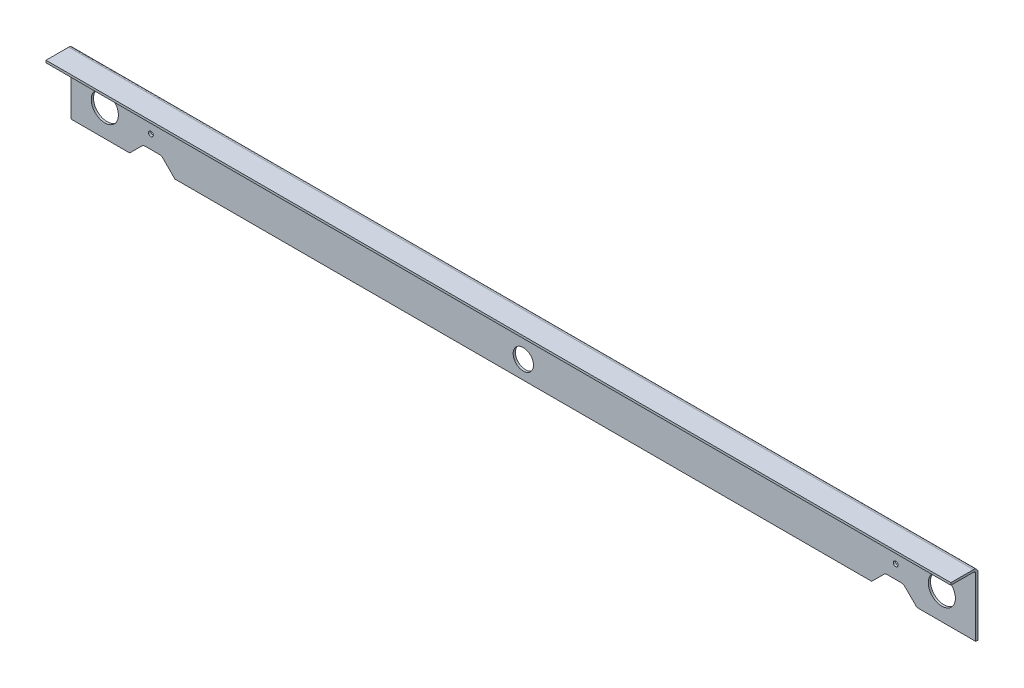
ISO-10303-21;
HEADER;
FILE_DESCRIPTION(('STEP AP214'),'2;1');
FILE_NAME('part.step','',(''),(''),'','','');
FILE_SCHEMA(('AUTOMOTIVE_DESIGN { 1 0 10303 214 1 1 1 1 }'));
ENDSEC;
DATA;
#1=APPLICATION_CONTEXT('core data for automotive mechanical design processes');
#2=APPLICATION_PROTOCOL_DEFINITION('international standard','automotive_design',2000,#1);
#3=PRODUCT_CONTEXT('',#1,'mechanical');
#4=PRODUCT('Part','Part','',(#3));
#5=PRODUCT_RELATED_PRODUCT_CATEGORY('part','',(#4));
#6=PRODUCT_DEFINITION_FORMATION('','',#4);
#7=PRODUCT_DEFINITION_CONTEXT('part definition',#1,'design');
#8=PRODUCT_DEFINITION('design','',#6,#7);
#9=PRODUCT_DEFINITION_SHAPE('','',#8);
#10=(LENGTH_UNIT() NAMED_UNIT(*) SI_UNIT(.MILLI.,.METRE.));
#11=(NAMED_UNIT(*) PLANE_ANGLE_UNIT() SI_UNIT($,.RADIAN.));
#12=(NAMED_UNIT(*) SI_UNIT($,.STERADIAN.) SOLID_ANGLE_UNIT());
#13=UNCERTAINTY_MEASURE_WITH_UNIT(LENGTH_MEASURE(1.E-05),#10,'distance_accuracy_value','');
#14=(GEOMETRIC_REPRESENTATION_CONTEXT(3) GLOBAL_UNCERTAINTY_ASSIGNED_CONTEXT((#13)) GLOBAL_UNIT_ASSIGNED_CONTEXT((#10,
#11,#12)) REPRESENTATION_CONTEXT('',''));
#15=CARTESIAN_POINT('',(0.,0.,0.));
#16=DIRECTION('',(0.,0.,1.));
#17=DIRECTION('',(1.,0.,0.));
#18=AXIS2_PLACEMENT_3D('',#15,#16,#17);
#19=CARTESIAN_POINT('',(635.,0.,34.925));
#20=DIRECTION('',(0.,0.,1.));
#21=DIRECTION('',(1.,0.,0.));
#22=AXIS2_PLACEMENT_3D('',#19,#20,#21);
#23=PLANE('',#22);
#24=DIRECTION('',(1.,0.,0.));
#25=VECTOR('',#24,1.);
#26=CARTESIAN_POINT('',(635.,-3.175,34.925));
#27=LINE('',#26,#25);
#28=CARTESIAN_POINT('',(635.,-3.175,34.925));
#29=VERTEX_POINT('',#28);
#30=CARTESIAN_POINT('',(-635.,-3.175,34.925));
#31=VERTEX_POINT('',#30);
#32=EDGE_CURVE('E106',#29,#31,#27,.F.);
#33=ORIENTED_EDGE('',*,*,#32,.F.);
#34=DIRECTION('',(0.,1.,0.));
#35=VECTOR('',#34,1.);
#36=CARTESIAN_POINT('',(635.,0.,34.925));
#37=LINE('',#36,#35);
#38=CARTESIAN_POINT('',(635.,0.,34.925));
#39=VERTEX_POINT('',#38);
#40=EDGE_CURVE('E247',#39,#29,#37,.F.);
#41=ORIENTED_EDGE('',*,*,#40,.F.);
#42=DIRECTION('',(1.,0.,0.));
#43=VECTOR('',#42,1.);
#44=CARTESIAN_POINT('',(-635.,0.,34.925));
#45=LINE('',#44,#43);
#46=CARTESIAN_POINT('',(-635.,0.,34.925));
#47=VERTEX_POINT('',#46);
#48=EDGE_CURVE('E157',#47,#39,#45,.T.);
#49=ORIENTED_EDGE('',*,*,#48,.F.);
#50=DIRECTION('',(0.,1.,0.));
#51=VECTOR('',#50,1.);
#52=CARTESIAN_POINT('',(-635.,0.,34.925));
#53=LINE('',#52,#51);
#54=EDGE_CURVE('E272',#47,#31,#53,.F.);
#55=ORIENTED_EDGE('',*,*,#54,.T.);
#56=EDGE_LOOP('',(#33,#41,#49,#55));
#57=FACE_BOUND('',#56,.T.);
#58=ADVANCED_FACE('F17',(#57),#23,.T.);
#59=CARTESIAN_POINT('',(635.,-3.175,34.925));
#60=DIRECTION('',(0.,-1.,0.));
#61=DIRECTION('',(0.,0.,-1.));
#62=AXIS2_PLACEMENT_3D('',#59,#60,#61);
#63=PLANE('',#62);
#64=DIRECTION('',(0.,0.,-1.));
#65=VECTOR('',#64,1.);
#66=CARTESIAN_POINT('',(-635.,-3.175,0.));
#67=LINE('',#66,#65);
#68=CARTESIAN_POINT('',(-635.,-3.175,3.175));
#69=VERTEX_POINT('',#68);
#70=EDGE_CURVE('E274',#31,#69,#67,.T.);
#71=ORIENTED_EDGE('',*,*,#70,.T.);
#72=DIRECTION('',(1.,0.,0.));
#73=VECTOR('',#72,1.);
#74=CARTESIAN_POINT('',(-2290.572,-3.175,3.175));
#75=LINE('',#74,#73);
#76=CARTESIAN_POINT('',(635.,-3.175,3.175));
#77=VERTEX_POINT('',#76);
#78=EDGE_CURVE('E95',#69,#77,#75,.T.);
#79=ORIENTED_EDGE('',*,*,#78,.T.);
#80=DIRECTION('',(0.,0.,-1.));
#81=VECTOR('',#80,1.);
#82=CARTESIAN_POINT('',(635.,-3.175,0.));
#83=LINE('',#82,#81);
#84=EDGE_CURVE('E244',#29,#77,#83,.T.);
#85=ORIENTED_EDGE('',*,*,#84,.F.);
#86=ORIENTED_EDGE('',*,*,#32,.T.);
#87=EDGE_LOOP('',(#71,#79,#85,#86));
#88=FACE_BOUND('',#87,.T.);
#89=ADVANCED_FACE('F706',(#88),#63,.T.);
#90=CARTESIAN_POINT('',(-2290.572,-6.35,3.175));
#91=DIRECTION('',(1.,0.,0.));
#92=DIRECTION('',(0.,0.,-1.));
#93=AXIS2_PLACEMENT_3D('',#90,#91,#92);
#94=CYLINDRICAL_SURFACE('',#93,3.175);
#95=ORIENTED_EDGE('',*,*,#78,.F.);
#96=CARTESIAN_POINT('',(-635.,-6.35,3.175));
#97=DIRECTION('',(1.,0.,0.));
#98=DIRECTION('',(0.,0.,-1.));
#99=AXIS2_PLACEMENT_3D('',#96,#97,#98);
#100=CIRCLE('',#99,3.175);
#101=CARTESIAN_POINT('',(-635.,-6.35,0.));
#102=VERTEX_POINT('',#101);
#103=EDGE_CURVE('E366',#69,#102,#100,.F.);
#104=ORIENTED_EDGE('',*,*,#103,.T.);
#105=DIRECTION('',(1.,0.,0.));
#106=VECTOR('',#105,1.);
#107=CARTESIAN_POINT('',(-635.,-6.35,0.));
#108=LINE('',#107,#106);
#109=CARTESIAN_POINT('',(635.,-6.35,0.));
#110=VERTEX_POINT('',#109);
#111=EDGE_CURVE('E253',#110,#102,#108,.F.);
#112=ORIENTED_EDGE('',*,*,#111,.F.);
#113=CARTESIAN_POINT('',(635.,-6.35,3.175));
#114=DIRECTION('',(1.,0.,0.));
#115=DIRECTION('',(0.,0.,-1.));
#116=AXIS2_PLACEMENT_3D('',#113,#114,#115);
#117=CIRCLE('',#116,3.175);
#118=EDGE_CURVE('E20',#77,#110,#117,.F.);
#119=ORIENTED_EDGE('',*,*,#118,.F.);
#120=EDGE_LOOP('',(#95,#104,#112,#119));
#121=FACE_BOUND('',#120,.T.);
#122=ADVANCED_FACE('F697',(#121),#94,.F.);
#123=CARTESIAN_POINT('',(-635.,0.,-3.175));
#124=DIRECTION('',(0.,1.,0.));
#125=DIRECTION('',(0.,0.,1.));
#126=AXIS2_PLACEMENT_3D('',#123,#124,#125);
#127=PLANE('',#126);
#128=DIRECTION('',(0.,0.,-1.));
#129=VECTOR('',#128,1.);
#130=CARTESIAN_POINT('',(635.,0.,0.));
#131=LINE('',#130,#129);
#132=CARTESIAN_POINT('',(635.,0.,3.175));
#133=VERTEX_POINT('',#132);
#134=EDGE_CURVE('E250',#133,#39,#131,.F.);
#135=ORIENTED_EDGE('',*,*,#134,.F.);
#136=DIRECTION('',(-1.,0.,0.));
#137=VECTOR('',#136,1.);
#138=CARTESIAN_POINT('',(2290.572,0.,3.175));
#139=LINE('',#138,#137);
#140=CARTESIAN_POINT('',(-635.,0.,3.175));
#141=VERTEX_POINT('',#140);
#142=EDGE_CURVE('E256',#141,#133,#139,.F.);
#143=ORIENTED_EDGE('',*,*,#142,.F.);
#144=DIRECTION('',(0.,0.,-1.));
#145=VECTOR('',#144,1.);
#146=CARTESIAN_POINT('',(-635.,0.,0.));
#147=LINE('',#146,#145);
#148=EDGE_CURVE('E275',#141,#47,#147,.F.);
#149=ORIENTED_EDGE('',*,*,#148,.T.);
#150=ORIENTED_EDGE('',*,*,#48,.T.);
#151=EDGE_LOOP('',(#135,#143,#149,#150));
#152=FACE_BOUND('',#151,.T.);
#153=ADVANCED_FACE('F688',(#152),#127,.T.);
#154=CARTESIAN_POINT('',(-635.,0.,0.));
#155=DIRECTION('',(0.,0.,1.));
#156=DIRECTION('',(1.,0.,0.));
#157=AXIS2_PLACEMENT_3D('',#154,#155,#156);
#158=PLANE('',#157);
#159=CARTESIAN_POINT('',(522.6558,-50.8,0.));
#160=DIRECTION('',(0.,0.,1.));
#161=DIRECTION('',(1.,0.,0.));
#162=AXIS2_PLACEMENT_3D('',#159,#160,#161);
#163=CIRCLE('',#162,3.3655);
#164=CARTESIAN_POINT('',(526.0213,-50.8,0.));
#165=VERTEX_POINT('',#164);
#166=EDGE_CURVE('E238',#165,#165,#163,.F.);
#167=ORIENTED_EDGE('',*,*,#166,.T.);
#168=EDGE_LOOP('',(#167));
#169=FACE_BOUND('',#168,.T.);
#170=CARTESIAN_POINT('',(522.6558,-22.225,0.));
#171=DIRECTION('',(0.,0.,1.));
#172=DIRECTION('',(1.,0.,0.));
#173=AXIS2_PLACEMENT_3D('',#170,#171,#172);
#174=CIRCLE('',#173,3.3655);
#175=CARTESIAN_POINT('',(526.0213,-22.225,0.));
#176=VERTEX_POINT('',#175);
#177=EDGE_CURVE('E345',#176,#176,#174,.F.);
#178=ORIENTED_EDGE('',*,*,#177,.T.);
#179=EDGE_LOOP('',(#178));
#180=FACE_BOUND('',#179,.T.);
#181=CARTESIAN_POINT('',(-522.6558,-22.225,0.));
#182=DIRECTION('',(0.,0.,1.));
#183=DIRECTION('',(1.,0.,0.));
#184=AXIS2_PLACEMENT_3D('',#181,#182,#183);
#185=CIRCLE('',#184,3.3655);
#186=CARTESIAN_POINT('',(-519.2903,-22.225,0.));
#187=VERTEX_POINT('',#186);
#188=EDGE_CURVE('E348',#187,#187,#185,.F.);
#189=ORIENTED_EDGE('',*,*,#188,.T.);
#190=EDGE_LOOP('',(#189));
#191=FACE_BOUND('',#190,.T.);
#192=CARTESIAN_POINT('',(-522.6558,-50.8,0.));
#193=DIRECTION('',(0.,0.,1.));
#194=DIRECTION('',(1.,0.,0.));
#195=AXIS2_PLACEMENT_3D('',#192,#193,#194);
#196=CIRCLE('',#195,3.3655);
#197=CARTESIAN_POINT('',(-519.2903,-50.8,0.));
#198=VERTEX_POINT('',#197);
#199=EDGE_CURVE('E351',#198,#198,#196,.F.);
#200=ORIENTED_EDGE('',*,*,#199,.T.);
#201=EDGE_LOOP('',(#200));
#202=FACE_BOUND('',#201,.T.);
#203=CARTESIAN_POINT('',(-587.375,-50.8,0.));
#204=DIRECTION('',(0.,0.,1.));
#205=DIRECTION('',(1.,0.,0.));
#206=AXIS2_PLACEMENT_3D('',#203,#204,#205);
#207=CIRCLE('',#206,19.05);
#208=CARTESIAN_POINT('',(-568.325,-50.8,0.));
#209=VERTEX_POINT('',#208);
#210=EDGE_CURVE('E354',#209,#209,#207,.F.);
#211=ORIENTED_EDGE('',*,*,#210,.T.);
#212=EDGE_LOOP('',(#211));
#213=FACE_BOUND('',#212,.T.);
#214=CARTESIAN_POINT('',(0.,-63.5,0.));
#215=DIRECTION('',(0.,0.,1.));
#216=DIRECTION('',(1.,0.,0.));
#217=AXIS2_PLACEMENT_3D('',#214,#215,#216);
#218=CIRCLE('',#217,14.2875);
#219=CARTESIAN_POINT('',(14.2875,-63.5,0.));
#220=VERTEX_POINT('',#219);
#221=EDGE_CURVE('E357',#220,#220,#218,.F.);
#222=ORIENTED_EDGE('',*,*,#221,.T.);
#223=EDGE_LOOP('',(#222));
#224=FACE_BOUND('',#223,.T.);
#225=CARTESIAN_POINT('',(587.375,-50.8,0.));
#226=DIRECTION('',(0.,0.,1.));
#227=DIRECTION('',(1.,0.,0.));
#228=AXIS2_PLACEMENT_3D('',#225,#226,#227);
#229=CIRCLE('',#228,19.05);
#230=CARTESIAN_POINT('',(606.425,-50.8,0.));
#231=VERTEX_POINT('',#230);
#232=EDGE_CURVE('E360',#231,#231,#229,.F.);
#233=ORIENTED_EDGE('',*,*,#232,.T.);
#234=EDGE_LOOP('',(#233));
#235=FACE_BOUND('',#234,.T.);
#236=DIRECTION('',(0.,1.,0.));
#237=VECTOR('',#236,1.);
#238=CARTESIAN_POINT('',(635.,0.,0.));
#239=LINE('',#238,#237);
#240=CARTESIAN_POINT('',(635.,-88.9,0.));
#241=VERTEX_POINT('',#240);
#242=EDGE_CURVE('E233',#110,#241,#239,.F.);
#243=ORIENTED_EDGE('',*,*,#242,.F.);
#244=ORIENTED_EDGE('',*,*,#111,.T.);
#245=DIRECTION('',(0.,1.,0.));
#246=VECTOR('',#245,1.);
#247=CARTESIAN_POINT('',(-635.,0.,0.));
#248=LINE('',#247,#246);
#249=CARTESIAN_POINT('',(-635.,-88.9,0.));
#250=VERTEX_POINT('',#249);
#251=EDGE_CURVE('E368',#102,#250,#248,.F.);
#252=ORIENTED_EDGE('',*,*,#251,.T.);
#253=DIRECTION('',(1.,0.,0.));
#254=VECTOR('',#253,1.);
#255=CARTESIAN_POINT('',(-635.,-88.9,0.));
#256=LINE('',#255,#254);
#257=CARTESIAN_POINT('',(-552.449999999987,-88.9000000000127,0.));
#258=VERTEX_POINT('',#257);
#259=EDGE_CURVE('E164',#258,#250,#256,.F.);
#260=ORIENTED_EDGE('',*,*,#259,.F.);
#261=DIRECTION('',(-0.707106781186548,-0.707106781186548,0.));
#262=VECTOR('',#261,1.);
#263=CARTESIAN_POINT('',(-535.25987193938,-71.7098719394562,0.));
#264=LINE('',#263,#262);
#265=CARTESIAN_POINT('',(-535.259871939424,-71.7098719395007,0.));
#266=VERTEX_POINT('',#265);
#267=EDGE_CURVE('E281',#258,#266,#264,.F.);
#268=ORIENTED_EDGE('',*,*,#267,.T.);
#269=CARTESIAN_POINT('',(-530.769743879014,-76.2,0.));
#270=DIRECTION('',(0.,0.,1.));
#271=DIRECTION('',(1.,0.,0.));
#272=AXIS2_PLACEMENT_3D('',#269,#270,#271);
#273=CIRCLE('',#272,6.35);
#274=CARTESIAN_POINT('',(-530.769743879014,-69.85,0.));
#275=VERTEX_POINT('',#274);
#276=EDGE_CURVE('E369',#266,#275,#273,.F.);
#277=ORIENTED_EDGE('',*,*,#276,.T.);
#278=DIRECTION('',(1.,0.,0.));
#279=VECTOR('',#278,1.);
#280=CARTESIAN_POINT('',(-510.630256120986,-69.85,0.));
#281=LINE('',#280,#279);
#282=CARTESIAN_POINT('',(-510.630256120986,-69.85,0.));
#283=VERTEX_POINT('',#282);
#284=EDGE_CURVE('E286',#275,#283,#281,.T.);
#285=ORIENTED_EDGE('',*,*,#284,.T.);
#286=CARTESIAN_POINT('',(-510.630256120986,-76.2,0.));
#287=DIRECTION('',(0.,0.,1.));
#288=DIRECTION('',(1.,0.,0.));
#289=AXIS2_PLACEMENT_3D('',#286,#287,#288);
#290=CIRCLE('',#289,6.35);
#291=CARTESIAN_POINT('',(-506.140128060517,-71.7098719394418,0.));
#292=VERTEX_POINT('',#291);
#293=EDGE_CURVE('E371',#283,#292,#290,.F.);
#294=ORIENTED_EDGE('',*,*,#293,.T.);
#295=DIRECTION('',(-0.707106781186548,0.707106781186548,0.));
#296=VECTOR('',#295,1.);
#297=CARTESIAN_POINT('',(-488.95,-88.9,0.));
#298=LINE('',#297,#296);
#299=CARTESIAN_POINT('',(-488.95,-88.9,0.));
#300=VERTEX_POINT('',#299);
#301=EDGE_CURVE('E175',#292,#300,#298,.F.);
#302=ORIENTED_EDGE('',*,*,#301,.T.);
#303=DIRECTION('',(1.,0.,0.));
#304=VECTOR('',#303,1.);
#305=CARTESIAN_POINT('',(-635.,-88.9,0.));
#306=LINE('',#305,#304);
#307=CARTESIAN_POINT('',(488.95,-88.9,0.));
#308=VERTEX_POINT('',#307);
#309=EDGE_CURVE('E177',#308,#300,#306,.F.);
#310=ORIENTED_EDGE('',*,*,#309,.F.);
#311=DIRECTION('',(0.707106781186548,0.707106781186548,0.));
#312=VECTOR('',#311,1.);
#313=CARTESIAN_POINT('',(488.95,-88.9,0.));
#314=LINE('',#313,#312);
#315=CARTESIAN_POINT('',(506.140128060537,-71.7098719394626,0.));
#316=VERTEX_POINT('',#315);
#317=EDGE_CURVE('E181',#316,#308,#314,.F.);
#318=ORIENTED_EDGE('',*,*,#317,.F.);
#319=CARTESIAN_POINT('',(510.630256120986,-76.2,0.));
#320=DIRECTION('',(0.,0.,-1.));
#321=DIRECTION('',(-1.,0.,0.));
#322=AXIS2_PLACEMENT_3D('',#319,#320,#321);
#323=CIRCLE('',#322,6.35);
#324=CARTESIAN_POINT('',(510.630256120986,-69.85,0.));
#325=VERTEX_POINT('',#324);
#326=EDGE_CURVE('E211',#316,#325,#323,.T.);
#327=ORIENTED_EDGE('',*,*,#326,.T.);
#328=DIRECTION('',(1.,0.,0.));
#329=VECTOR('',#328,1.);
#330=CARTESIAN_POINT('',(510.630256120986,-69.85,0.));
#331=LINE('',#330,#329);
#332=CARTESIAN_POINT('',(530.769743879014,-69.85,0.));
#333=VERTEX_POINT('',#332);
#334=EDGE_CURVE('E215',#333,#325,#331,.F.);
#335=ORIENTED_EDGE('',*,*,#334,.F.);
#336=CARTESIAN_POINT('',(530.769743879014,-76.2,0.));
#337=DIRECTION('',(0.,0.,-1.));
#338=DIRECTION('',(-1.,0.,0.));
#339=AXIS2_PLACEMENT_3D('',#336,#337,#338);
#340=CIRCLE('',#339,6.35);
#341=CARTESIAN_POINT('',(535.259871939464,-71.7098719394608,0.));
#342=VERTEX_POINT('',#341);
#343=EDGE_CURVE('E217',#333,#342,#340,.T.);
#344=ORIENTED_EDGE('',*,*,#343,.T.);
#345=DIRECTION('',(0.707106781186548,-0.707106781186548,0.));
#346=VECTOR('',#345,1.);
#347=CARTESIAN_POINT('',(535.25987193938,-71.7098719394562,0.));
#348=LINE('',#347,#346);
#349=CARTESIAN_POINT('',(552.449999999975,-88.9000000000254,0.));
#350=VERTEX_POINT('',#349);
#351=EDGE_CURVE('E219',#350,#342,#348,.F.);
#352=ORIENTED_EDGE('',*,*,#351,.F.);
#353=DIRECTION('',(1.,0.,0.));
#354=VECTOR('',#353,1.);
#355=CARTESIAN_POINT('',(-635.,-88.9,0.));
#356=LINE('',#355,#354);
#357=EDGE_CURVE('E220',#241,#350,#356,.F.);
#358=ORIENTED_EDGE('',*,*,#357,.F.);
#359=EDGE_LOOP('',(#243,#244,#252,#260,#268,#277,#285,#294,#302,#310,#318,#327,#335,#344,#352,#358));
#360=FACE_BOUND('',#359,.T.);
#361=ADVANCED_FACE('F180',(#169,#180,#191,#202,#213,#224,#235,#360),#158,.T.);
#362=CARTESIAN_POINT('',(635.,0.,0.));
#363=DIRECTION('',(1.,0.,0.));
#364=DIRECTION('',(0.,0.,-1.));
#365=AXIS2_PLACEMENT_3D('',#362,#363,#364);
#366=PLANE('',#365);
#367=DIRECTION('',(0.,1.,0.));
#368=VECTOR('',#367,1.);
#369=CARTESIAN_POINT('',(635.,-88.9,-3.175));
#370=LINE('',#369,#368);
#371=CARTESIAN_POINT('',(635.,-6.35,-3.175));
#372=VERTEX_POINT('',#371);
#373=CARTESIAN_POINT('',(635.,-88.9,-3.175));
#374=VERTEX_POINT('',#373);
#375=EDGE_CURVE('E227',#372,#374,#370,.F.);
#376=ORIENTED_EDGE('',*,*,#375,.F.);
#377=CARTESIAN_POINT('',(635.,-6.35,3.175));
#378=DIRECTION('',(-1.,0.,0.));
#379=DIRECTION('',(0.,0.,1.));
#380=AXIS2_PLACEMENT_3D('',#377,#378,#379);
#381=CIRCLE('',#380,6.35);
#382=EDGE_CURVE('E259',#133,#372,#381,.T.);
#383=ORIENTED_EDGE('',*,*,#382,.F.);
#384=ORIENTED_EDGE('',*,*,#134,.T.);
#385=ORIENTED_EDGE('',*,*,#40,.T.);
#386=ORIENTED_EDGE('',*,*,#84,.T.);
#387=ORIENTED_EDGE('',*,*,#118,.T.);
#388=ORIENTED_EDGE('',*,*,#242,.T.);
#389=DIRECTION('',(0.,0.,-1.));
#390=VECTOR('',#389,1.);
#391=CARTESIAN_POINT('',(635.,-88.9,0.));
#392=LINE('',#391,#390);
#393=EDGE_CURVE('E230',#374,#241,#392,.F.);
#394=ORIENTED_EDGE('',*,*,#393,.F.);
#395=EDGE_LOOP('',(#376,#383,#384,#385,#386,#387,#388,#394));
#396=FACE_BOUND('',#395,.T.);
#397=ADVANCED_FACE('F452',(#396),#366,.T.);
#398=CARTESIAN_POINT('',(-635.,-88.9,0.));
#399=DIRECTION('',(0.,-1.,0.));
#400=DIRECTION('',(0.,0.,-1.));
#401=AXIS2_PLACEMENT_3D('',#398,#399,#400);
#402=PLANE('',#401);
#403=ORIENTED_EDGE('',*,*,#357,.T.);
#404=DIRECTION('',(0.,0.,1.));
#405=VECTOR('',#404,1.);
#406=CARTESIAN_POINT('',(552.449999999962,-88.9000000000381,0.));
#407=LINE('',#406,#405);
#408=CARTESIAN_POINT('',(552.449999999988,-88.9000000000128,-3.175));
#409=VERTEX_POINT('',#408);
#410=EDGE_CURVE('E147',#409,#350,#407,.T.);
#411=ORIENTED_EDGE('',*,*,#410,.F.);
#412=DIRECTION('',(-1.,0.,0.));
#413=VECTOR('',#412,1.);
#414=CARTESIAN_POINT('',(-635.,-88.9,-3.175));
#415=LINE('',#414,#413);
#416=EDGE_CURVE('E223',#374,#409,#415,.T.);
#417=ORIENTED_EDGE('',*,*,#416,.F.);
#418=ORIENTED_EDGE('',*,*,#393,.T.);
#419=EDGE_LOOP('',(#403,#411,#417,#418));
#420=FACE_BOUND('',#419,.T.);
#421=ADVANCED_FACE('F454',(#420),#402,.T.);
#422=CARTESIAN_POINT('',(535.25987193938,-71.7098719394562,0.));
#423=DIRECTION('',(-0.707106781186548,-0.707106781186548,0.));
#424=DIRECTION('',(0.707106781186548,-0.707106781186548,0.));
#425=AXIS2_PLACEMENT_3D('',#422,#423,#424);
#426=PLANE('',#425);
#427=ORIENTED_EDGE('',*,*,#351,.T.);
#428=DIRECTION('',(0.,0.,-1.));
#429=VECTOR('',#428,1.);
#430=CARTESIAN_POINT('',(535.25987193946,-71.7098719393765,0.));
#431=LINE('',#430,#429);
#432=CARTESIAN_POINT('',(535.259871939459,-71.7098719394558,-3.175));
#433=VERTEX_POINT('',#432);
#434=EDGE_CURVE('E138',#342,#433,#431,.T.);
#435=ORIENTED_EDGE('',*,*,#434,.T.);
#436=DIRECTION('',(-0.707106781188118,0.707106781184977,0.));
#437=VECTOR('',#436,1.);
#438=CARTESIAN_POINT('',(552.45,-88.9,-3.175));
#439=LINE('',#438,#437);
#440=EDGE_CURVE('E226',#409,#433,#439,.T.);
#441=ORIENTED_EDGE('',*,*,#440,.F.);
#442=ORIENTED_EDGE('',*,*,#410,.T.);
#443=EDGE_LOOP('',(#427,#435,#441,#442));
#444=FACE_BOUND('',#443,.T.);
#445=ADVANCED_FACE('F377',(#444),#426,.T.);
#446=CARTESIAN_POINT('',(530.769743879014,-76.2,0.));
#447=DIRECTION('',(0.,0.,-1.));
#448=DIRECTION('',(-1.,0.,0.));
#449=AXIS2_PLACEMENT_3D('',#446,#447,#448);
#450=CYLINDRICAL_SURFACE('',#449,6.35);
#451=ORIENTED_EDGE('',*,*,#434,.F.);
#452=ORIENTED_EDGE('',*,*,#343,.F.);
#453=DIRECTION('',(0.,0.,-1.));
#454=VECTOR('',#453,1.);
#455=CARTESIAN_POINT('',(530.769743879014,-69.85,0.));
#456=LINE('',#455,#454);
#457=CARTESIAN_POINT('',(530.769743879014,-69.85,-3.175));
#458=VERTEX_POINT('',#457);
#459=EDGE_CURVE('E212',#458,#333,#456,.F.);
#460=ORIENTED_EDGE('',*,*,#459,.F.);
#461=CARTESIAN_POINT('',(530.769743879014,-76.2,-3.175));
#462=DIRECTION('',(0.,0.,-1.));
#463=DIRECTION('',(-1.,0.,0.));
#464=AXIS2_PLACEMENT_3D('',#461,#462,#463);
#465=CIRCLE('',#464,6.35);
#466=EDGE_CURVE('E340',#433,#458,#465,.F.);
#467=ORIENTED_EDGE('',*,*,#466,.F.);
#468=EDGE_LOOP('',(#451,#452,#460,#467));
#469=FACE_BOUND('',#468,.T.);
#470=ADVANCED_FACE('F378',(#469),#450,.F.);
#471=CARTESIAN_POINT('',(510.630256120986,-69.85,0.));
#472=DIRECTION('',(0.,-1.,0.));
#473=DIRECTION('',(0.,0.,-1.));
#474=AXIS2_PLACEMENT_3D('',#471,#472,#473);
#475=PLANE('',#474);
#476=ORIENTED_EDGE('',*,*,#334,.T.);
#477=DIRECTION('',(0.,0.,-1.));
#478=VECTOR('',#477,1.);
#479=CARTESIAN_POINT('',(510.630256120986,-69.85,0.));
#480=LINE('',#479,#478);
#481=CARTESIAN_POINT('',(510.630256120986,-69.85,-3.175));
#482=VERTEX_POINT('',#481);
#483=EDGE_CURVE('E194',#325,#482,#480,.T.);
#484=ORIENTED_EDGE('',*,*,#483,.T.);
#485=DIRECTION('',(-1.,0.,0.));
#486=VECTOR('',#485,1.);
#487=CARTESIAN_POINT('',(-635.,-69.85,-3.175));
#488=LINE('',#487,#486);
#489=EDGE_CURVE('E339',#458,#482,#488,.T.);
#490=ORIENTED_EDGE('',*,*,#489,.F.);
#491=ORIENTED_EDGE('',*,*,#459,.T.);
#492=EDGE_LOOP('',(#476,#484,#490,#491));
#493=FACE_BOUND('',#492,.T.);
#494=ADVANCED_FACE('F530',(#493),#475,.T.);
#495=CARTESIAN_POINT('',(510.630256120986,-76.2,0.));
#496=DIRECTION('',(0.,0.,-1.));
#497=DIRECTION('',(-1.,0.,0.));
#498=AXIS2_PLACEMENT_3D('',#495,#496,#497);
#499=CYLINDRICAL_SURFACE('',#498,6.35);
#500=ORIENTED_EDGE('',*,*,#483,.F.);
#501=ORIENTED_EDGE('',*,*,#326,.F.);
#502=DIRECTION('',(0.,0.,1.));
#503=VECTOR('',#502,1.);
#504=CARTESIAN_POINT('',(506.140128060582,-71.7098719394181,0.));
#505=LINE('',#504,#503);
#506=CARTESIAN_POINT('',(506.140128060561,-71.7098719394766,-3.175));
#507=VERTEX_POINT('',#506);
#508=EDGE_CURVE('E187',#507,#316,#505,.T.);
#509=ORIENTED_EDGE('',*,*,#508,.F.);
#510=CARTESIAN_POINT('',(510.630256120986,-76.2,-3.175));
#511=DIRECTION('',(0.,0.,-1.));
#512=DIRECTION('',(-1.,0.,0.));
#513=AXIS2_PLACEMENT_3D('',#510,#511,#512);
#514=CIRCLE('',#513,6.35);
#515=EDGE_CURVE('E335',#482,#507,#514,.F.);
#516=ORIENTED_EDGE('',*,*,#515,.F.);
#517=EDGE_LOOP('',(#500,#501,#509,#516));
#518=FACE_BOUND('',#517,.T.);
#519=ADVANCED_FACE('F527',(#518),#499,.F.);
#520=CARTESIAN_POINT('',(488.95,-88.9,0.));
#521=DIRECTION('',(0.707106781186548,-0.707106781186548,0.));
#522=DIRECTION('',(0.707106781186548,0.707106781186548,0.));
#523=AXIS2_PLACEMENT_3D('',#520,#521,#522);
#524=PLANE('',#523);
#525=DIRECTION('',(-0.707106781188113,-0.707106781184982,0.));
#526=VECTOR('',#525,1.);
#527=CARTESIAN_POINT('',(506.14012806062,-71.7098719394562,-3.175));
#528=LINE('',#527,#526);
#529=CARTESIAN_POINT('',(488.95,-88.9,-3.175));
#530=VERTEX_POINT('',#529);
#531=EDGE_CURVE('E338',#507,#530,#528,.T.);
#532=ORIENTED_EDGE('',*,*,#531,.F.);
#533=ORIENTED_EDGE('',*,*,#508,.T.);
#534=ORIENTED_EDGE('',*,*,#317,.T.);
#535=DIRECTION('',(0.,0.,-1.));
#536=VECTOR('',#535,1.);
#537=CARTESIAN_POINT('',(488.95,-88.9,0.));
#538=LINE('',#537,#536);
#539=EDGE_CURVE('E186',#530,#308,#538,.F.);
#540=ORIENTED_EDGE('',*,*,#539,.F.);
#541=EDGE_LOOP('',(#532,#533,#534,#540));
#542=FACE_BOUND('',#541,.T.);
#543=ADVANCED_FACE('F192',(#542),#524,.T.);
#544=CARTESIAN_POINT('',(-635.,-88.9,0.));
#545=DIRECTION('',(0.,-1.,0.));
#546=DIRECTION('',(0.,0.,-1.));
#547=AXIS2_PLACEMENT_3D('',#544,#545,#546);
#548=PLANE('',#547);
#549=DIRECTION('',(-1.,0.,0.));
#550=VECTOR('',#549,1.);
#551=CARTESIAN_POINT('',(-635.,-88.9,-3.175));
#552=LINE('',#551,#550);
#553=CARTESIAN_POINT('',(-488.95,-88.9,-3.175));
#554=VERTEX_POINT('',#553);
#555=EDGE_CURVE('E198',#530,#554,#552,.T.);
#556=ORIENTED_EDGE('',*,*,#555,.F.);
#557=ORIENTED_EDGE('',*,*,#539,.T.);
#558=ORIENTED_EDGE('',*,*,#309,.T.);
#559=DIRECTION('',(0.,0.,1.));
#560=VECTOR('',#559,1.);
#561=CARTESIAN_POINT('',(-488.95,-88.9,0.));
#562=LINE('',#561,#560);
#563=EDGE_CURVE('E201',#300,#554,#562,.F.);
#564=ORIENTED_EDGE('',*,*,#563,.T.);
#565=EDGE_LOOP('',(#556,#557,#558,#564));
#566=FACE_BOUND('',#565,.T.);
#567=ADVANCED_FACE('F196',(#566),#548,.T.);
#568=CARTESIAN_POINT('',(-488.95,-88.9,0.));
#569=DIRECTION('',(0.707106781186548,0.707106781186548,0.));
#570=DIRECTION('',(-0.707106781186548,0.707106781186548,0.));
#571=AXIS2_PLACEMENT_3D('',#568,#569,#570);
#572=PLANE('',#571);
#573=DIRECTION('',(-0.707106781188113,0.707106781184982,0.));
#574=VECTOR('',#573,1.);
#575=CARTESIAN_POINT('',(-488.95,-88.9,-3.175));
#576=LINE('',#575,#574);
#577=CARTESIAN_POINT('',(-506.140128060541,-71.7098719394558,-3.175));
#578=VERTEX_POINT('',#577);
#579=EDGE_CURVE('E334',#554,#578,#576,.T.);
#580=ORIENTED_EDGE('',*,*,#579,.F.);
#581=ORIENTED_EDGE('',*,*,#563,.F.);
#582=ORIENTED_EDGE('',*,*,#301,.F.);
#583=DIRECTION('',(0.,0.,1.));
#584=VECTOR('',#583,1.);
#585=CARTESIAN_POINT('',(-506.14012806054,-71.7098719393765,0.));
#586=LINE('',#585,#584);
#587=EDGE_CURVE('E288',#292,#578,#586,.F.);
#588=ORIENTED_EDGE('',*,*,#587,.T.);
#589=EDGE_LOOP('',(#580,#581,#582,#588));
#590=FACE_BOUND('',#589,.T.);
#591=ADVANCED_FACE('F518',(#590),#572,.F.);
#592=CARTESIAN_POINT('',(-510.630256120986,-76.2,0.));
#593=DIRECTION('',(0.,0.,1.));
#594=DIRECTION('',(1.,0.,0.));
#595=AXIS2_PLACEMENT_3D('',#592,#593,#594);
#596=CYLINDRICAL_SURFACE('',#595,6.35);
#597=CARTESIAN_POINT('',(-510.630256120986,-76.2,-3.175));
#598=DIRECTION('',(0.,0.,1.));
#599=DIRECTION('',(1.,0.,0.));
#600=AXIS2_PLACEMENT_3D('',#597,#598,#599);
#601=CIRCLE('',#600,6.35);
#602=CARTESIAN_POINT('',(-510.630256120986,-69.85,-3.175));
#603=VERTEX_POINT('',#602);
#604=EDGE_CURVE('E331',#578,#603,#601,.T.);
#605=ORIENTED_EDGE('',*,*,#604,.F.);
#606=ORIENTED_EDGE('',*,*,#587,.F.);
#607=ORIENTED_EDGE('',*,*,#293,.F.);
#608=DIRECTION('',(0.,0.,1.));
#609=VECTOR('',#608,1.);
#610=CARTESIAN_POINT('',(-510.630256120986,-69.85,0.));
#611=LINE('',#610,#609);
#612=EDGE_CURVE('E287',#283,#603,#611,.F.);
#613=ORIENTED_EDGE('',*,*,#612,.T.);
#614=EDGE_LOOP('',(#605,#606,#607,#613));
#615=FACE_BOUND('',#614,.T.);
#616=ADVANCED_FACE('F514',(#615),#596,.F.);
#617=CARTESIAN_POINT('',(-510.630256120986,-69.85,0.));
#618=DIRECTION('',(0.,1.,0.));
#619=DIRECTION('',(0.,0.,1.));
#620=AXIS2_PLACEMENT_3D('',#617,#618,#619);
#621=PLANE('',#620);
#622=DIRECTION('',(-1.,0.,0.));
#623=VECTOR('',#622,1.);
#624=CARTESIAN_POINT('',(-635.,-69.85,-3.175));
#625=LINE('',#624,#623);
#626=CARTESIAN_POINT('',(-530.769743879014,-69.85,-3.175));
#627=VERTEX_POINT('',#626);
#628=EDGE_CURVE('E330',#603,#627,#625,.T.);
#629=ORIENTED_EDGE('',*,*,#628,.F.);
#630=ORIENTED_EDGE('',*,*,#612,.F.);
#631=ORIENTED_EDGE('',*,*,#284,.F.);
#632=DIRECTION('',(0.,0.,1.));
#633=VECTOR('',#632,1.);
#634=CARTESIAN_POINT('',(-530.769743879014,-69.85,0.));
#635=LINE('',#634,#633);
#636=EDGE_CURVE('E283',#275,#627,#635,.F.);
#637=ORIENTED_EDGE('',*,*,#636,.T.);
#638=EDGE_LOOP('',(#629,#630,#631,#637));
#639=FACE_BOUND('',#638,.T.);
#640=ADVANCED_FACE('F510',(#639),#621,.F.);
#641=CARTESIAN_POINT('',(-530.769743879014,-76.2,0.));
#642=DIRECTION('',(0.,0.,1.));
#643=DIRECTION('',(1.,0.,0.));
#644=AXIS2_PLACEMENT_3D('',#641,#642,#643);
#645=CYLINDRICAL_SURFACE('',#644,6.35);
#646=CARTESIAN_POINT('',(-530.769743879014,-76.2,-3.175));
#647=DIRECTION('',(0.,0.,1.));
#648=DIRECTION('',(1.,0.,0.));
#649=AXIS2_PLACEMENT_3D('',#646,#647,#648);
#650=CIRCLE('',#649,6.35);
#651=CARTESIAN_POINT('',(-535.259871939419,-71.7098719394957,-3.175));
#652=VERTEX_POINT('',#651);
#653=EDGE_CURVE('E326',#627,#652,#650,.T.);
#654=ORIENTED_EDGE('',*,*,#653,.F.);
#655=ORIENTED_EDGE('',*,*,#636,.F.);
#656=ORIENTED_EDGE('',*,*,#276,.F.);
#657=DIRECTION('',(0.,0.,1.));
#658=VECTOR('',#657,1.);
#659=CARTESIAN_POINT('',(-535.25987193938,-71.7098719394562,0.));
#660=LINE('',#659,#658);
#661=EDGE_CURVE('E263',#266,#652,#660,.F.);
#662=ORIENTED_EDGE('',*,*,#661,.T.);
#663=EDGE_LOOP('',(#654,#655,#656,#662));
#664=FACE_BOUND('',#663,.T.);
#665=ADVANCED_FACE('F507',(#664),#645,.F.);
#666=CARTESIAN_POINT('',(-535.25987193938,-71.7098719394562,0.));
#667=DIRECTION('',(-0.707106781186548,0.707106781186548,0.));
#668=DIRECTION('',(-0.707106781186548,-0.707106781186548,0.));
#669=AXIS2_PLACEMENT_3D('',#666,#667,#668);
#670=PLANE('',#669);
#671=DIRECTION('',(-0.707106781188116,-0.707106781184979,0.));
#672=VECTOR('',#671,1.);
#673=CARTESIAN_POINT('',(-535.25987193938,-71.7098719394562,-3.175));
#674=LINE('',#673,#672);
#675=CARTESIAN_POINT('',(-552.45,-88.9,-3.175));
#676=VERTEX_POINT('',#675);
#677=EDGE_CURVE('E329',#652,#676,#674,.T.);
#678=ORIENTED_EDGE('',*,*,#677,.F.);
#679=ORIENTED_EDGE('',*,*,#661,.F.);
#680=ORIENTED_EDGE('',*,*,#267,.F.);
#681=DIRECTION('',(0.,0.,-1.));
#682=VECTOR('',#681,1.);
#683=CARTESIAN_POINT('',(-552.45,-88.9,0.));
#684=LINE('',#683,#682);
#685=EDGE_CURVE('E262',#676,#258,#684,.F.);
#686=ORIENTED_EDGE('',*,*,#685,.F.);
#687=EDGE_LOOP('',(#678,#679,#680,#686));
#688=FACE_BOUND('',#687,.T.);
#689=ADVANCED_FACE('F442',(#688),#670,.F.);
#690=CARTESIAN_POINT('',(-635.,-88.9,0.));
#691=DIRECTION('',(0.,-1.,0.));
#692=DIRECTION('',(0.,0.,-1.));
#693=AXIS2_PLACEMENT_3D('',#690,#691,#692);
#694=PLANE('',#693);
#695=DIRECTION('',(-1.,0.,0.));
#696=VECTOR('',#695,1.);
#697=CARTESIAN_POINT('',(-635.,-88.9,-3.175));
#698=LINE('',#697,#696);
#699=CARTESIAN_POINT('',(-635.,-88.9,-3.175));
#700=VERTEX_POINT('',#699);
#701=EDGE_CURVE('E404',#676,#700,#698,.T.);
#702=ORIENTED_EDGE('',*,*,#701,.F.);
#703=ORIENTED_EDGE('',*,*,#685,.T.);
#704=ORIENTED_EDGE('',*,*,#259,.T.);
#705=DIRECTION('',(0.,0.,-1.));
#706=VECTOR('',#705,1.);
#707=CARTESIAN_POINT('',(-635.,-88.9,0.));
#708=LINE('',#707,#706);
#709=EDGE_CURVE('E260',#250,#700,#708,.T.);
#710=ORIENTED_EDGE('',*,*,#709,.T.);
#711=EDGE_LOOP('',(#702,#703,#704,#710));
#712=FACE_BOUND('',#711,.T.);
#713=ADVANCED_FACE('F444',(#712),#694,.T.);
#714=CARTESIAN_POINT('',(-635.,0.,0.));
#715=DIRECTION('',(1.,0.,0.));
#716=DIRECTION('',(0.,0.,-1.));
#717=AXIS2_PLACEMENT_3D('',#714,#715,#716);
#718=PLANE('',#717);
#719=ORIENTED_EDGE('',*,*,#709,.F.);
#720=ORIENTED_EDGE('',*,*,#251,.F.);
#721=ORIENTED_EDGE('',*,*,#103,.F.);
#722=ORIENTED_EDGE('',*,*,#70,.F.);
#723=ORIENTED_EDGE('',*,*,#54,.F.);
#724=ORIENTED_EDGE('',*,*,#148,.F.);
#725=CARTESIAN_POINT('',(-635.,-6.35,3.175));
#726=DIRECTION('',(-1.,0.,0.));
#727=DIRECTION('',(0.,0.,1.));
#728=AXIS2_PLACEMENT_3D('',#725,#726,#727);
#729=CIRCLE('',#728,6.35);
#730=CARTESIAN_POINT('',(-635.,-6.34999999999999,-3.175));
#731=VERTEX_POINT('',#730);
#732=EDGE_CURVE('E35',#731,#141,#729,.F.);
#733=ORIENTED_EDGE('',*,*,#732,.F.);
#734=DIRECTION('',(0.,1.,0.));
#735=VECTOR('',#734,1.);
#736=CARTESIAN_POINT('',(-635.,-88.9,-3.175));
#737=LINE('',#736,#735);
#738=EDGE_CURVE('E402',#700,#731,#737,.T.);
#739=ORIENTED_EDGE('',*,*,#738,.F.);
#740=EDGE_LOOP('',(#719,#720,#721,#722,#723,#724,#733,#739));
#741=FACE_BOUND('',#740,.T.);
#742=ADVANCED_FACE('F447',(#741),#718,.F.);
#743=CARTESIAN_POINT('',(2290.572,-6.35,3.175));
#744=DIRECTION('',(-1.,0.,0.));
#745=DIRECTION('',(0.,0.,1.));
#746=AXIS2_PLACEMENT_3D('',#743,#744,#745);
#747=CYLINDRICAL_SURFACE('',#746,6.35);
#748=DIRECTION('',(-1.,0.,0.));
#749=VECTOR('',#748,1.);
#750=CARTESIAN_POINT('',(-635.,-6.34999999999999,-3.175));
#751=LINE('',#750,#749);
#752=EDGE_CURVE('E325',#731,#372,#751,.F.);
#753=ORIENTED_EDGE('',*,*,#752,.F.);
#754=ORIENTED_EDGE('',*,*,#732,.T.);
#755=ORIENTED_EDGE('',*,*,#142,.T.);
#756=ORIENTED_EDGE('',*,*,#382,.T.);
#757=EDGE_LOOP('',(#753,#754,#755,#756));
#758=FACE_BOUND('',#757,.T.);
#759=ADVANCED_FACE('F449',(#758),#747,.T.);
#760=CARTESIAN_POINT('',(587.375,-50.8,0.));
#761=DIRECTION('',(0.,0.,1.));
#762=DIRECTION('',(1.,0.,0.));
#763=AXIS2_PLACEMENT_3D('',#760,#761,#762);
#764=CYLINDRICAL_SURFACE('',#763,19.05);
#765=CARTESIAN_POINT('',(587.375,-50.8,-3.175));
#766=DIRECTION('',(0.,0.,1.));
#767=DIRECTION('',(1.,0.,0.));
#768=AXIS2_PLACEMENT_3D('',#765,#766,#767);
#769=CIRCLE('',#768,19.05);
#770=CARTESIAN_POINT('',(606.425,-50.8,-3.175));
#771=VERTEX_POINT('',#770);
#772=EDGE_CURVE('E322',#771,#771,#769,.T.);
#773=ORIENTED_EDGE('',*,*,#772,.F.);
#774=EDGE_LOOP('',(#773));
#775=FACE_BOUND('',#774,.T.);
#776=ORIENTED_EDGE('',*,*,#232,.F.);
#777=EDGE_LOOP('',(#776));
#778=FACE_BOUND('',#777,.T.);
#779=ADVANCED_FACE('F494',(#775,#778),#764,.F.);
#780=CARTESIAN_POINT('',(0.,-63.5,0.));
#781=DIRECTION('',(0.,0.,1.));
#782=DIRECTION('',(1.,0.,0.));
#783=AXIS2_PLACEMENT_3D('',#780,#781,#782);
#784=CYLINDRICAL_SURFACE('',#783,14.2875);
#785=CARTESIAN_POINT('',(0.,-63.5,-3.175));
#786=DIRECTION('',(0.,0.,1.));
#787=DIRECTION('',(1.,0.,0.));
#788=AXIS2_PLACEMENT_3D('',#785,#786,#787);
#789=CIRCLE('',#788,14.2875);
#790=CARTESIAN_POINT('',(14.2875,-63.5,-3.175));
#791=VERTEX_POINT('',#790);
#792=EDGE_CURVE('E319',#791,#791,#789,.T.);
#793=ORIENTED_EDGE('',*,*,#792,.F.);
#794=EDGE_LOOP('',(#793));
#795=FACE_BOUND('',#794,.T.);
#796=ORIENTED_EDGE('',*,*,#221,.F.);
#797=EDGE_LOOP('',(#796));
#798=FACE_BOUND('',#797,.T.);
#799=ADVANCED_FACE('F490',(#795,#798),#784,.F.);
#800=CARTESIAN_POINT('',(-587.375,-50.8,0.));
#801=DIRECTION('',(0.,0.,1.));
#802=DIRECTION('',(1.,0.,0.));
#803=AXIS2_PLACEMENT_3D('',#800,#801,#802);
#804=CYLINDRICAL_SURFACE('',#803,19.05);
#805=CARTESIAN_POINT('',(-587.375,-50.8,-3.175));
#806=DIRECTION('',(0.,0.,1.));
#807=DIRECTION('',(1.,0.,0.));
#808=AXIS2_PLACEMENT_3D('',#805,#806,#807);
#809=CIRCLE('',#808,19.05);
#810=CARTESIAN_POINT('',(-568.325,-50.8,-3.175));
#811=VERTEX_POINT('',#810);
#812=EDGE_CURVE('E316',#811,#811,#809,.T.);
#813=ORIENTED_EDGE('',*,*,#812,.F.);
#814=EDGE_LOOP('',(#813));
#815=FACE_BOUND('',#814,.T.);
#816=ORIENTED_EDGE('',*,*,#210,.F.);
#817=EDGE_LOOP('',(#816));
#818=FACE_BOUND('',#817,.T.);
#819=ADVANCED_FACE('F486',(#815,#818),#804,.F.);
#820=CARTESIAN_POINT('',(-522.6558,-50.8,0.));
#821=DIRECTION('',(0.,0.,1.));
#822=DIRECTION('',(1.,0.,0.));
#823=AXIS2_PLACEMENT_3D('',#820,#821,#822);
#824=CYLINDRICAL_SURFACE('',#823,3.3655);
#825=CARTESIAN_POINT('',(-522.6558,-50.8,-3.175));
#826=DIRECTION('',(0.,0.,1.));
#827=DIRECTION('',(1.,0.,0.));
#828=AXIS2_PLACEMENT_3D('',#825,#826,#827);
#829=CIRCLE('',#828,3.3655);
#830=CARTESIAN_POINT('',(-519.2903,-50.8,-3.175));
#831=VERTEX_POINT('',#830);
#832=EDGE_CURVE('E313',#831,#831,#829,.T.);
#833=ORIENTED_EDGE('',*,*,#832,.F.);
#834=EDGE_LOOP('',(#833));
#835=FACE_BOUND('',#834,.T.);
#836=ORIENTED_EDGE('',*,*,#199,.F.);
#837=EDGE_LOOP('',(#836));
#838=FACE_BOUND('',#837,.T.);
#839=ADVANCED_FACE('F482',(#835,#838),#824,.F.);
#840=CARTESIAN_POINT('',(-522.6558,-22.225,0.));
#841=DIRECTION('',(0.,0.,1.));
#842=DIRECTION('',(1.,0.,0.));
#843=AXIS2_PLACEMENT_3D('',#840,#841,#842);
#844=CYLINDRICAL_SURFACE('',#843,3.3655);
#845=CARTESIAN_POINT('',(-522.6558,-22.225,-3.175));
#846=DIRECTION('',(0.,0.,1.));
#847=DIRECTION('',(1.,0.,0.));
#848=AXIS2_PLACEMENT_3D('',#845,#846,#847);
#849=CIRCLE('',#848,3.3655);
#850=CARTESIAN_POINT('',(-519.2903,-22.225,-3.175));
#851=VERTEX_POINT('',#850);
#852=EDGE_CURVE('E310',#851,#851,#849,.T.);
#853=ORIENTED_EDGE('',*,*,#852,.F.);
#854=EDGE_LOOP('',(#853));
#855=FACE_BOUND('',#854,.T.);
#856=ORIENTED_EDGE('',*,*,#188,.F.);
#857=EDGE_LOOP('',(#856));
#858=FACE_BOUND('',#857,.T.);
#859=ADVANCED_FACE('F478',(#855,#858),#844,.F.);
#860=CARTESIAN_POINT('',(522.6558,-22.225,0.));
#861=DIRECTION('',(0.,0.,1.));
#862=DIRECTION('',(1.,0.,0.));
#863=AXIS2_PLACEMENT_3D('',#860,#861,#862);
#864=CYLINDRICAL_SURFACE('',#863,3.3655);
#865=CARTESIAN_POINT('',(522.6558,-22.225,-3.175));
#866=DIRECTION('',(0.,0.,1.));
#867=DIRECTION('',(1.,0.,0.));
#868=AXIS2_PLACEMENT_3D('',#865,#866,#867);
#869=CIRCLE('',#868,3.3655);
#870=CARTESIAN_POINT('',(526.0213,-22.225,-3.175));
#871=VERTEX_POINT('',#870);
#872=EDGE_CURVE('E26',#871,#871,#869,.T.);
#873=ORIENTED_EDGE('',*,*,#872,.F.);
#874=EDGE_LOOP('',(#873));
#875=FACE_BOUND('',#874,.T.);
#876=ORIENTED_EDGE('',*,*,#177,.F.);
#877=EDGE_LOOP('',(#876));
#878=FACE_BOUND('',#877,.T.);
#879=ADVANCED_FACE('F471',(#875,#878),#864,.F.);
#880=CARTESIAN_POINT('',(522.6558,-50.8,0.));
#881=DIRECTION('',(0.,0.,1.));
#882=DIRECTION('',(1.,0.,0.));
#883=AXIS2_PLACEMENT_3D('',#880,#881,#882);
#884=CYLINDRICAL_SURFACE('',#883,3.3655);
#885=CARTESIAN_POINT('',(522.6558,-50.8,-3.175));
#886=DIRECTION('',(0.,0.,1.));
#887=DIRECTION('',(1.,0.,0.));
#888=AXIS2_PLACEMENT_3D('',#885,#886,#887);
#889=CIRCLE('',#888,3.3655);
#890=CARTESIAN_POINT('',(526.0213,-50.8,-3.175));
#891=VERTEX_POINT('',#890);
#892=EDGE_CURVE('E11',#891,#891,#889,.T.);
#893=ORIENTED_EDGE('',*,*,#892,.F.);
#894=EDGE_LOOP('',(#893));
#895=FACE_BOUND('',#894,.T.);
#896=ORIENTED_EDGE('',*,*,#166,.F.);
#897=EDGE_LOOP('',(#896));
#898=FACE_BOUND('',#897,.T.);
#899=ADVANCED_FACE('F465',(#895,#898),#884,.F.);
#900=CARTESIAN_POINT('',(-635.,-88.9,-3.175));
#901=DIRECTION('',(0.,0.,-1.));
#902=DIRECTION('',(-1.,0.,0.));
#903=AXIS2_PLACEMENT_3D('',#900,#901,#902);
#904=PLANE('',#903);
#905=ORIENTED_EDGE('',*,*,#892,.T.);
#906=EDGE_LOOP('',(#905));
#907=FACE_BOUND('',#906,.T.);
#908=ORIENTED_EDGE('',*,*,#872,.T.);
#909=EDGE_LOOP('',(#908));
#910=FACE_BOUND('',#909,.T.);
#911=ORIENTED_EDGE('',*,*,#852,.T.);
#912=EDGE_LOOP('',(#911));
#913=FACE_BOUND('',#912,.T.);
#914=ORIENTED_EDGE('',*,*,#832,.T.);
#915=EDGE_LOOP('',(#914));
#916=FACE_BOUND('',#915,.T.);
#917=ORIENTED_EDGE('',*,*,#812,.T.);
#918=EDGE_LOOP('',(#917));
#919=FACE_BOUND('',#918,.T.);
#920=ORIENTED_EDGE('',*,*,#792,.T.);
#921=EDGE_LOOP('',(#920));
#922=FACE_BOUND('',#921,.T.);
#923=ORIENTED_EDGE('',*,*,#772,.T.);
#924=EDGE_LOOP('',(#923));
#925=FACE_BOUND('',#924,.T.);
#926=ORIENTED_EDGE('',*,*,#738,.T.);
#927=ORIENTED_EDGE('',*,*,#752,.T.);
#928=ORIENTED_EDGE('',*,*,#375,.T.);
#929=ORIENTED_EDGE('',*,*,#416,.T.);
#930=ORIENTED_EDGE('',*,*,#440,.T.);
#931=ORIENTED_EDGE('',*,*,#466,.T.);
#932=ORIENTED_EDGE('',*,*,#489,.T.);
#933=ORIENTED_EDGE('',*,*,#515,.T.);
#934=ORIENTED_EDGE('',*,*,#531,.T.);
#935=ORIENTED_EDGE('',*,*,#555,.T.);
#936=ORIENTED_EDGE('',*,*,#579,.T.);
#937=ORIENTED_EDGE('',*,*,#604,.T.);
#938=ORIENTED_EDGE('',*,*,#628,.T.);
#939=ORIENTED_EDGE('',*,*,#653,.T.);
#940=ORIENTED_EDGE('',*,*,#677,.T.);
#941=ORIENTED_EDGE('',*,*,#701,.T.);
#942=EDGE_LOOP('',(#926,#927,#928,#929,#930,#931,#932,#933,#934,#935,#936,#937,#938,#939,#940,#941));
#943=FACE_BOUND('',#942,.T.);
#944=ADVANCED_FACE('F384',(#907,#910,#913,#916,#919,#922,#925,#943),#904,.T.);
#945=CLOSED_SHELL('',(#58,#89,#122,#153,#361,#397,#421,#445,#470,#494,#519,#543,#567,#591,#616,
#640,#665,#689,#713,#742,#759,#779,#799,#819,#839,#859,#879,#899,#944));
#946=MANIFOLD_SOLID_BREP('B1',#945);
#947=ADVANCED_BREP_SHAPE_REPRESENTATION('',(#18,#946),#14);
#948=SHAPE_DEFINITION_REPRESENTATION(#9,#947);
ENDSEC;
END-ISO-10303-21;
